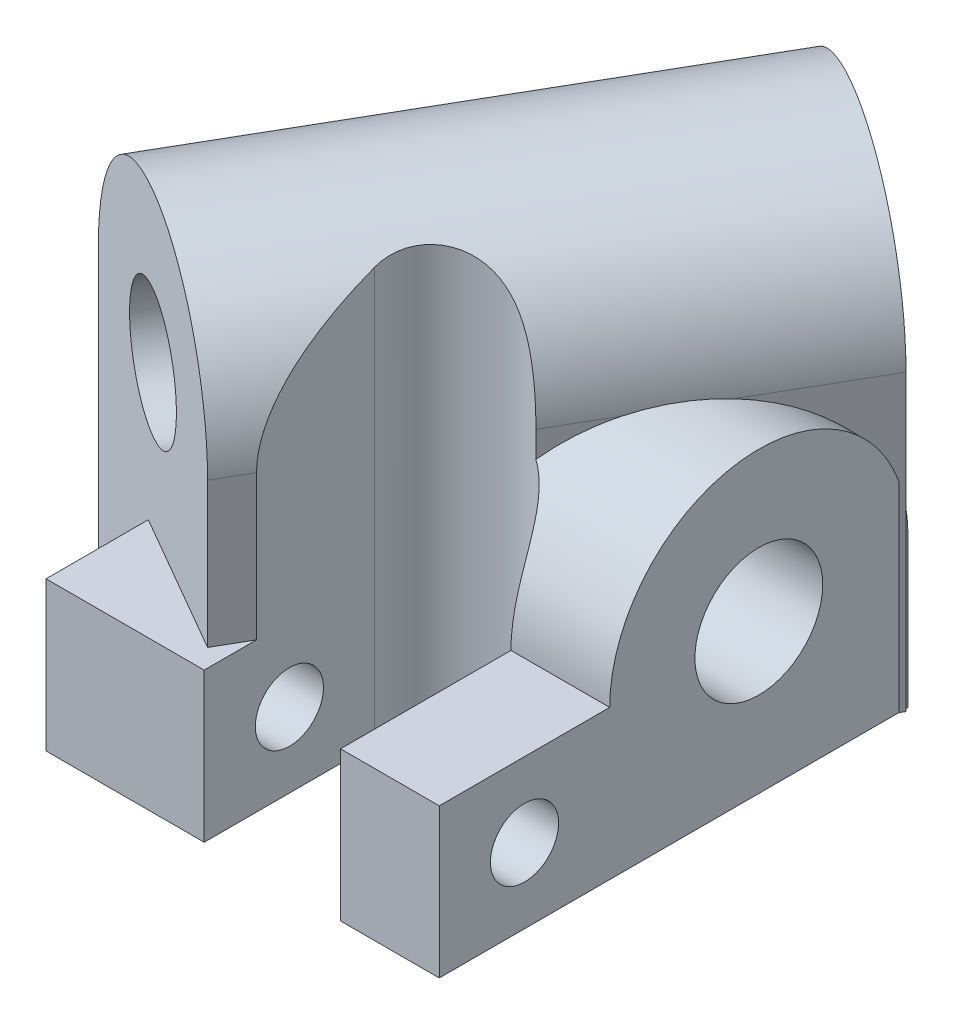
ISO-10303-21;
HEADER;
FILE_DESCRIPTION(('STEP AP214'),'2;1');
FILE_NAME('part.step','',(''),(''),'','','');
FILE_SCHEMA(('AUTOMOTIVE_DESIGN { 1 0 10303 214 1 1 1 1 }'));
ENDSEC;
DATA;
#1=APPLICATION_CONTEXT('core data for automotive mechanical design processes');
#2=APPLICATION_PROTOCOL_DEFINITION('international standard','automotive_design',2000,#1);
#3=PRODUCT_CONTEXT('',#1,'mechanical');
#4=PRODUCT('Part','Part','',(#3));
#5=PRODUCT_RELATED_PRODUCT_CATEGORY('part','',(#4));
#6=PRODUCT_DEFINITION_FORMATION('','',#4);
#7=PRODUCT_DEFINITION_CONTEXT('part definition',#1,'design');
#8=PRODUCT_DEFINITION('design','',#6,#7);
#9=PRODUCT_DEFINITION_SHAPE('','',#8);
#10=(LENGTH_UNIT() NAMED_UNIT(*) SI_UNIT(.MILLI.,.METRE.));
#11=(NAMED_UNIT(*) PLANE_ANGLE_UNIT() SI_UNIT($,.RADIAN.));
#12=(NAMED_UNIT(*) SI_UNIT($,.STERADIAN.) SOLID_ANGLE_UNIT());
#13=UNCERTAINTY_MEASURE_WITH_UNIT(LENGTH_MEASURE(1.E-05),#10,'distance_accuracy_value','');
#14=(GEOMETRIC_REPRESENTATION_CONTEXT(3) GLOBAL_UNCERTAINTY_ASSIGNED_CONTEXT((#13)) GLOBAL_UNIT_ASSIGNED_CONTEXT((#10,
#11,#12)) REPRESENTATION_CONTEXT('',''));
#15=CARTESIAN_POINT('',(0.,0.,0.));
#16=DIRECTION('',(0.,0.,1.));
#17=DIRECTION('',(1.,0.,0.));
#18=AXIS2_PLACEMENT_3D('',#15,#16,#17);
#19=CARTESIAN_POINT('',(30.1554445662278,17.25,-8.48076211353301));
#20=DIRECTION('',(-0.866025403784436,0.,-0.500000000000004));
#21=DIRECTION('',(-0.500000000000004,0.,0.866025403784436));
#22=AXIS2_PLACEMENT_3D('',#19,#20,#21);
#23=PLANE('',#22);
#24=DIRECTION('',(-0.500000000000004,0.,0.866025403784436));
#25=VECTOR('',#24,1.);
#26=CARTESIAN_POINT('',(30.1554445662278,17.25,-8.48076211353301));
#27=LINE('',#26,#25);
#28=CARTESIAN_POINT('',(24.0601163962181,17.25,2.07665596572951));
#29=VERTEX_POINT('',#28);
#30=CARTESIAN_POINT('',(22.207259421637,17.25,5.28589838486226));
#31=VERTEX_POINT('',#30);
#32=EDGE_CURVE('E326',#29,#31,#27,.T.);
#33=ORIENTED_EDGE('',*,*,#32,.T.);
#34=DIRECTION('',(0.,-1.,0.));
#35=VECTOR('',#34,1.);
#36=CARTESIAN_POINT('',(22.207259421637,26.,5.28589838486226));
#37=LINE('',#36,#35);
#38=CARTESIAN_POINT('',(22.207259421637,15.7229318270661,5.28589838486226));
#39=VERTEX_POINT('',#38);
#40=EDGE_CURVE('E40',#31,#39,#37,.T.);
#41=ORIENTED_EDGE('',*,*,#40,.T.);
#42=CARTESIAN_POINT('',(25.2590742770462,8.75,0.));
#43=DIRECTION('',(-0.866025403784436,0.,-0.500000000000004));
#44=DIRECTION('',(-0.500000000000004,0.,0.866025403784436));
#45=AXIS2_PLACEMENT_3D('',#42,#43,#44);
#46=ELLIPSE('',#45,10.1036297108185,8.75);
#47=EDGE_CURVE('E342',#39,#29,#46,.T.);
#48=ORIENTED_EDGE('',*,*,#47,.T.);
#49=EDGE_LOOP('',(#33,#41,#48));
#50=FACE_BOUND('',#49,.T.);
#51=ADVANCED_FACE('F32',(#50),#23,.F.);
#52=CARTESIAN_POINT('',(30.,8.75,0.));
#53=DIRECTION('',(1.,0.,0.));
#54=DIRECTION('',(0.,0.,-1.));
#55=AXIS2_PLACEMENT_3D('',#52,#53,#54);
#56=PLANE('',#55);
#57=CARTESIAN_POINT('',(30.,4.375,13.75));
#58=DIRECTION('',(1.,0.,0.));
#59=DIRECTION('',(0.,0.,-1.));
#60=AXIS2_PLACEMENT_3D('',#57,#58,#59);
#61=CIRCLE('',#60,2.);
#62=CARTESIAN_POINT('',(30.,4.375,11.75));
#63=VERTEX_POINT('',#62);
#64=EDGE_CURVE('E192',#63,#63,#61,.T.);
#65=ORIENTED_EDGE('',*,*,#64,.F.);
#66=EDGE_LOOP('',(#65));
#67=FACE_BOUND('',#66,.T.);
#68=CARTESIAN_POINT('',(30.,8.75,0.));
#69=DIRECTION('',(1.,0.,0.));
#70=DIRECTION('',(0.,0.,-1.));
#71=AXIS2_PLACEMENT_3D('',#68,#69,#70);
#72=CIRCLE('',#71,3.75);
#73=CARTESIAN_POINT('',(30.,8.75,-3.75));
#74=VERTEX_POINT('',#73);
#75=EDGE_CURVE('E356',#74,#74,#72,.T.);
#76=ORIENTED_EDGE('',*,*,#75,.F.);
#77=EDGE_LOOP('',(#76));
#78=FACE_BOUND('',#77,.T.);
#79=DIRECTION('',(0.,0.,-1.));
#80=VECTOR('',#79,1.);
#81=CARTESIAN_POINT('',(30.,0.,8.75));
#82=LINE('',#81,#80);
#83=CARTESIAN_POINT('',(30.,0.,18.75));
#84=VERTEX_POINT('',#83);
#85=CARTESIAN_POINT('',(30.,0.,-8.21152422706606));
#86=VERTEX_POINT('',#85);
#87=EDGE_CURVE('E319',#84,#86,#82,.T.);
#88=ORIENTED_EDGE('',*,*,#87,.T.);
#89=DIRECTION('',(0.,1.,0.));
#90=VECTOR('',#89,1.);
#91=CARTESIAN_POINT('',(30.,8.75000000000001,-8.21152422706605));
#92=LINE('',#91,#90);
#93=CARTESIAN_POINT('',(30.,11.772146566318,-8.21152422706604));
#94=VERTEX_POINT('',#93);
#95=EDGE_CURVE('E307',#86,#94,#92,.T.);
#96=ORIENTED_EDGE('',*,*,#95,.T.);
#97=CARTESIAN_POINT('',(30.,8.75,0.));
#98=DIRECTION('',(1.,0.,0.));
#99=DIRECTION('',(0.,0.,-1.));
#100=AXIS2_PLACEMENT_3D('',#97,#98,#99);
#101=CIRCLE('',#100,8.75);
#102=CARTESIAN_POINT('',(30.,8.75,8.75));
#103=VERTEX_POINT('',#102);
#104=EDGE_CURVE('E366',#94,#103,#101,.T.);
#105=ORIENTED_EDGE('',*,*,#104,.T.);
#106=DIRECTION('',(0.,0.,1.));
#107=VECTOR('',#106,1.);
#108=CARTESIAN_POINT('',(30.,8.75,18.75));
#109=LINE('',#108,#107);
#110=CARTESIAN_POINT('',(30.,8.75,18.75));
#111=VERTEX_POINT('',#110);
#112=EDGE_CURVE('E215',#103,#111,#109,.T.);
#113=ORIENTED_EDGE('',*,*,#112,.T.);
#114=DIRECTION('',(0.,-1.,0.));
#115=VECTOR('',#114,1.);
#116=CARTESIAN_POINT('',(30.,8.75,18.75));
#117=LINE('',#116,#115);
#118=EDGE_CURVE('E225',#111,#84,#117,.T.);
#119=ORIENTED_EDGE('',*,*,#118,.T.);
#120=EDGE_LOOP('',(#88,#96,#105,#113,#119));
#121=FACE_BOUND('',#120,.T.);
#122=ADVANCED_FACE('F286',(#67,#78,#121),#56,.T.);
#123=CARTESIAN_POINT('',(30.,0.,-8.75));
#124=DIRECTION('',(0.,0.,1.));
#125=DIRECTION('',(1.,0.,0.));
#126=AXIS2_PLACEMENT_3D('',#123,#124,#125);
#127=PLANE('',#126);
#128=DIRECTION('',(0.,1.,0.));
#129=VECTOR('',#128,1.);
#130=CARTESIAN_POINT('',(10.1036297108186,0.,-8.75));
#131=LINE('',#130,#129);
#132=CARTESIAN_POINT('',(10.1036297108186,0.,-8.75));
#133=VERTEX_POINT('',#132);
#134=CARTESIAN_POINT('',(10.1036297108186,8.75,-8.75));
#135=VERTEX_POINT('',#134);
#136=EDGE_CURVE('E347',#133,#135,#131,.T.);
#137=ORIENTED_EDGE('',*,*,#136,.F.);
#138=DIRECTION('',(-1.,0.,0.));
#139=VECTOR('',#138,1.);
#140=CARTESIAN_POINT('',(30.,0.,-8.75));
#141=LINE('',#140,#139);
#142=CARTESIAN_POINT('',(0.,0.,-8.75));
#143=VERTEX_POINT('',#142);
#144=EDGE_CURVE('E387',#133,#143,#141,.T.);
#145=ORIENTED_EDGE('',*,*,#144,.T.);
#146=DIRECTION('',(0.,1.,0.));
#147=VECTOR('',#146,1.);
#148=CARTESIAN_POINT('',(0.,0.,-8.75));
#149=LINE('',#148,#147);
#150=CARTESIAN_POINT('',(0.,8.75,-8.75));
#151=VERTEX_POINT('',#150);
#152=EDGE_CURVE('E376',#143,#151,#149,.T.);
#153=ORIENTED_EDGE('',*,*,#152,.T.);
#154=DIRECTION('',(-1.,0.,0.));
#155=VECTOR('',#154,1.);
#156=CARTESIAN_POINT('',(30.,8.75,-8.75));
#157=LINE('',#156,#155);
#158=EDGE_CURVE('E383',#135,#151,#157,.T.);
#159=ORIENTED_EDGE('',*,*,#158,.F.);
#160=EDGE_LOOP('',(#137,#145,#153,#159));
#161=FACE_BOUND('',#160,.T.);
#162=ADVANCED_FACE('F292',(#161),#127,.F.);
#163=CARTESIAN_POINT('',(30.,8.75,0.));
#164=DIRECTION('',(-1.,0.,0.));
#165=DIRECTION('',(0.,0.,1.));
#166=AXIS2_PLACEMENT_3D('',#163,#164,#165);
#167=CYLINDRICAL_SURFACE('',#166,8.75);
#168=CARTESIAN_POINT('',(5.05181485540928,8.75,0.));
#169=DIRECTION('',(0.866025403784436,0.,0.500000000000004));
#170=DIRECTION('',(-0.500000000000004,0.,0.866025403784436));
#171=AXIS2_PLACEMENT_3D('',#168,#169,#170);
#172=ELLIPSE('',#171,10.1036297108185,8.75);
#173=CARTESIAN_POINT('',(6.25077273623748,17.25,-2.07665596572953));
#174=VERTEX_POINT('',#173);
#175=EDGE_CURVE('E346',#135,#174,#172,.T.);
#176=ORIENTED_EDGE('',*,*,#175,.F.);
#177=ORIENTED_EDGE('',*,*,#158,.T.);
#178=CARTESIAN_POINT('',(0.,8.75,0.));
#179=DIRECTION('',(1.,0.,0.));
#180=DIRECTION('',(0.,0.,-1.));
#181=AXIS2_PLACEMENT_3D('',#178,#179,#180);
#182=CIRCLE('',#181,8.75);
#183=CARTESIAN_POINT('',(0.,8.75,8.75));
#184=VERTEX_POINT('',#183);
#185=EDGE_CURVE('E379',#151,#184,#182,.T.);
#186=ORIENTED_EDGE('',*,*,#185,.T.);
#187=CARTESIAN_POINT('',(3.85285697458108,17.25,2.07665596572953));
#188=VERTEX_POINT('',#187);
#189=EDGE_CURVE('E316',#188,#184,#172,.T.);
#190=ORIENTED_EDGE('',*,*,#189,.F.);
#191=CARTESIAN_POINT('',(6.25077273623748,17.25,-2.07665596572953));
#192=CARTESIAN_POINT('',(6.17045305423663,17.2839955158162,-1.93752118965594));
#193=CARTESIAN_POINT('',(6.08992669708827,17.3145407726905,-1.79766573743263));
#194=CARTESIAN_POINT('',(5.92845414899194,17.3687042069313,-1.51686167601603));
#195=CARTESIAN_POINT('',(5.84750796197914,17.3923224491074,-1.37591307706296));
#196=CARTESIAN_POINT('',(5.68514484693701,17.4326165812872,-1.09319356352859));
#197=CARTESIAN_POINT('',(5.60372769259806,17.4492887932685,-0.95142225349095));
#198=CARTESIAN_POINT('',(5.44052248566032,17.4756709734203,-0.667459190548528));
#199=CARTESIAN_POINT('',(5.35873443607839,17.4853809981191,-0.525267441066848));
#200=CARTESIAN_POINT('',(5.11573925489823,17.5038639870459,-0.10337892787786));
#201=CARTESIAN_POINT('',(4.95408084797536,17.5026841834947,0.176553909262585));
#202=CARTESIAN_POINT('',(4.63084663215437,17.4735677881277,0.734828019402746));
#203=CARTESIAN_POINT('',(4.46927083873285,17.4456487685698,1.01317021688613));
#204=CARTESIAN_POINT('',(4.23223408822682,17.3847720872609,1.42159042234583));
#205=CARTESIAN_POINT('',(4.15605832048719,17.3621389081463,1.55285602570154));
#206=CARTESIAN_POINT('',(4.00405358423578,17.3107093865198,1.8151228385504));
#207=CARTESIAN_POINT('',(3.92822735199661,17.2818879476154,1.94612071065994));
#208=CARTESIAN_POINT('',(3.85285697458108,17.25,2.07665596572953));
#209=B_SPLINE_CURVE_WITH_KNOTS('',3,(#191,#192,#193,#194,#195,#196,#197,#198,#199,#200,#201,
#202,#203,#204,#205,#206,#207,#208),.UNSPECIFIED.,.F.,.F.,(4,2,2,2,2,2,2,2,4),(0.,
0.492592446399339,0.985180283919886,1.47802862326541,1.97087296096945,2.93946951707011,
3.90742997531448,4.36766174258732,4.8297964680422),.UNSPECIFIED.);
#210=EDGE_CURVE('E396',#174,#188,#209,.T.);
#211=ORIENTED_EDGE('',*,*,#210,.F.);
#212=EDGE_LOOP('',(#176,#177,#186,#190,#211));
#213=FACE_BOUND('',#212,.T.);
#214=ADVANCED_FACE('F401',(#213),#167,.T.);
#215=ORIENTED_EDGE('',*,*,#47,.F.);
#216=CARTESIAN_POINT('',(20.1485029781668,16.0981902508714,4.75043156323701));
#217=CARTESIAN_POINT('',(20.2442905484469,16.0990964128763,4.74900732212532));
#218=CARTESIAN_POINT('',(20.340147948157,16.0977846801699,4.7510573078996));
#219=CARTESIAN_POINT('',(20.5312961580327,16.0907040057593,4.76200214444356));
#220=CARTESIAN_POINT('',(20.62658702579,16.0849355251989,4.77089628704157));
#221=CARTESIAN_POINT('',(20.8157295258631,16.0689359085176,4.79540143297364));
#222=CARTESIAN_POINT('',(20.9095836238424,16.0587135869906,4.81099916840711));
#223=CARTESIAN_POINT('',(21.0953686233684,16.033766116063,4.84868696111031));
#224=CARTESIAN_POINT('',(21.1872995379011,16.0190409970775,4.87077697452626));
#225=CARTESIAN_POINT('',(21.3685994212124,15.9850375665874,4.92114342029558));
#226=CARTESIAN_POINT('',(21.4579680864919,15.9657587181704,4.94942058212212));
#227=CARTESIAN_POINT('',(21.6335520283011,15.922594360825,5.01176888879183));
#228=CARTESIAN_POINT('',(21.7197661273677,15.898707152247,5.04584217080266));
#229=CARTESIAN_POINT('',(21.8883988079629,15.8463115266805,5.11926692057997));
#230=CARTESIAN_POINT('',(21.9708194290293,15.8178056310626,5.15861550651331));
#231=CARTESIAN_POINT('',(22.1314500792258,15.7561446364365,5.24205388875792));
#232=CARTESIAN_POINT('',(22.2096585272862,15.7229878082684,5.28614544702039));
#233=CARTESIAN_POINT('',(22.3623878181195,15.6516023087653,5.37901978809682));
#234=CARTESIAN_POINT('',(22.4368490599915,15.6133144581029,5.42785513484066));
#235=CARTESIAN_POINT('',(22.5806815743442,15.532071262806,5.52903532449174));
#236=CARTESIAN_POINT('',(22.6500510161901,15.4891142531241,5.58138141678472));
#237=CARTESIAN_POINT('',(22.8501243072632,15.3533953417673,5.74258791053661));
#238=CARTESIAN_POINT('',(22.9728849313336,15.2537427437506,5.85567365963137));
#239=CARTESIAN_POINT('',(23.2057052238415,15.0286627266507,6.09674370316369));
#240=CARTESIAN_POINT('',(23.3138600417606,14.9017811191412,6.22518494452467));
#241=CARTESIAN_POINT('',(23.5059358019272,14.6307178384615,6.48185911955175));
#242=CARTESIAN_POINT('',(23.5898470933866,14.4865293080448,6.61009195011167));
#243=CARTESIAN_POINT('',(23.7198716432647,14.2175353124912,6.8331524507467));
#244=CARTESIAN_POINT('',(23.7702412238995,14.0956033926039,6.92903900060324));
#245=CARTESIAN_POINT('',(23.8597585451508,13.8440902187252,7.11598849286189));
#246=CARTESIAN_POINT('',(23.8989012030552,13.7145055320458,7.20704923533813));
#247=CARTESIAN_POINT('',(23.9676996621239,13.4485035997608,7.38323022514537));
#248=CARTESIAN_POINT('',(23.9973320520409,13.3120704348112,7.46833541555332));
#249=CARTESIAN_POINT('',(24.0486423087337,13.0335826501128,7.63147986516758));
#250=CARTESIAN_POINT('',(24.0703178953492,12.8915264318802,7.70951709410827));
#251=CARTESIAN_POINT('',(24.1144027988967,12.5467185308072,7.88657843770023));
#252=CARTESIAN_POINT('',(24.1338506380246,12.3417505595027,7.98203912912937));
#253=CARTESIAN_POINT('',(24.1640542283199,11.9244550570637,8.15699620768429));
#254=CARTESIAN_POINT('',(24.174806091652,11.7121242783255,8.23648544229791));
#255=CARTESIAN_POINT('',(24.1906393837072,11.2817951419793,8.37877409245609));
#256=CARTESIAN_POINT('',(24.195721913766,11.0637978935737,8.44157674776165));
#257=CARTESIAN_POINT('',(24.2026277636208,10.6236455217183,8.55004817860867));
#258=CARTESIAN_POINT('',(24.2044523841605,10.4014920934668,8.59572378648859));
#259=CARTESIAN_POINT('',(24.2066875232759,9.94169498564568,8.67177305051995));
#260=CARTESIAN_POINT('',(24.2070127726699,9.70388260960126,8.70114204801667));
#261=CARTESIAN_POINT('',(24.2072217138656,9.34637171643065,8.73046961533928));
#262=CARTESIAN_POINT('',(24.2072450305433,9.22723348079246,8.7377911513655));
#263=CARTESIAN_POINT('',(24.2072603946276,8.98873497340255,8.74755669108357));
#264=CARTESIAN_POINT('',(24.2072524361939,8.86937466434113,8.74999978365514));
#265=CARTESIAN_POINT('',(24.2072594216369,8.75,8.75));
#266=B_SPLINE_CURVE_WITH_KNOTS('',3,(#216,#217,#218,#219,#220,#221,#222,#223,#224,#225,#226,
#227,#228,#229,#230,#231,#232,#233,#234,#235,#236,#237,#238,#239,#240,#241,#242,#243,#244,#245,
#246,#247,#248,#249,#250,#251,#252,#253,#254,#255,#256,#257,#258,#259,#260,#261,#262,#263,#264,
#265),.UNSPECIFIED.,.F.,.F.,(4,2,2,2,2,2,2,2,2,2,2,2,2,2,2,2,2,2,2,2,2,2,2,2,4),(0.,
0.287315853760752,0.574601982663118,0.861322108208879,1.14804029707345,1.4347923086337,
1.72165028259402,2.00835218333389,2.29516096025176,2.58561999366466,2.87618294829894,
3.45696385425701,4.08603684366191,4.71535990855098,5.20398572847379,5.69283241376325,
6.18287341429806,6.67305473517355,7.35290874207197,8.03306653333264,8.71309217278946,
9.39284624641988,10.1108166450022,10.4688201122941,10.8268904356908),.UNSPECIFIED.);
#267=CARTESIAN_POINT('',(24.2072594216369,8.75,8.75));
#268=VERTEX_POINT('',#267);
#269=EDGE_CURVE('E255',#39,#268,#266,.T.);
#270=ORIENTED_EDGE('',*,*,#269,.T.);
#271=DIRECTION('',(-1.,0.,0.));
#272=VECTOR('',#271,1.);
#273=CARTESIAN_POINT('',(30.,8.75,8.75));
#274=LINE('',#273,#272);
#275=EDGE_CURVE('E370',#103,#268,#274,.T.);
#276=ORIENTED_EDGE('',*,*,#275,.F.);
#277=ORIENTED_EDGE('',*,*,#104,.F.);
#278=CARTESIAN_POINT('',(26.4580321578744,17.25,-2.07665596572952));
#279=VERTEX_POINT('',#278);
#280=EDGE_CURVE('E313',#279,#94,#46,.T.);
#281=ORIENTED_EDGE('',*,*,#280,.F.);
#282=CARTESIAN_POINT('',(24.060116396218,17.25,2.07665596572952));
#283=CARTESIAN_POINT('',(24.1404360782189,17.2839955158162,1.93752118965593));
#284=CARTESIAN_POINT('',(24.2209624353673,17.3145407726905,1.79766573743262));
#285=CARTESIAN_POINT('',(24.3824349834636,17.3687042069313,1.51686167601602));
#286=CARTESIAN_POINT('',(24.4633811704764,17.3923224491074,1.37591307706295));
#287=CARTESIAN_POINT('',(24.6257442855185,17.4326165812872,1.09319356352858));
#288=CARTESIAN_POINT('',(24.7071614398575,17.4492887932685,0.951422253490937));
#289=CARTESIAN_POINT('',(24.8703666467952,17.4756709734203,0.667459190548515));
#290=CARTESIAN_POINT('',(24.9521546963771,17.4853809981191,0.525267441066837));
#291=CARTESIAN_POINT('',(25.1951498775573,17.5038639870459,0.103378927877851));
#292=CARTESIAN_POINT('',(25.3568082844802,17.5026841834947,-0.176553909262594));
#293=CARTESIAN_POINT('',(25.6800425003012,17.4735677881277,-0.734828019402755));
#294=CARTESIAN_POINT('',(25.8416182937227,17.4456487685698,-1.01317021688614));
#295=CARTESIAN_POINT('',(26.0786550442287,17.3847720872609,-1.42159042234583));
#296=CARTESIAN_POINT('',(26.1548308119683,17.3621389081463,-1.55285602570154));
#297=CARTESIAN_POINT('',(26.3068355482197,17.3107093865198,-1.8151228385504));
#298=CARTESIAN_POINT('',(26.3826617804589,17.2818879476154,-1.94612071065993));
#299=CARTESIAN_POINT('',(26.4580321578744,17.25,-2.07665596572952));
#300=B_SPLINE_CURVE_WITH_KNOTS('',3,(#282,#283,#284,#285,#286,#287,#288,#289,#290,#291,#292,
#293,#294,#295,#296,#297,#298,#299),.UNSPECIFIED.,.F.,.F.,(4,2,2,2,2,2,2,2,4),(0.,
0.49259244639934,0.985180283919886,1.47802862326541,1.97087296096945,2.9394695170701,
3.90742997531448,4.36766174258731,4.82979646804217),.UNSPECIFIED.);
#301=EDGE_CURVE('E390',#29,#279,#300,.T.);
#302=ORIENTED_EDGE('',*,*,#301,.F.);
#303=EDGE_LOOP('',(#215,#270,#276,#277,#281,#302));
#304=FACE_BOUND('',#303,.T.);
#305=ADVANCED_FACE('F405',(#304),#167,.T.);
#306=CARTESIAN_POINT('',(30.,8.75,-8.75));
#307=VERTEX_POINT('',#306);
#308=CARTESIAN_POINT('',(29.6891108675445,8.75,-8.75));
#309=VERTEX_POINT('',#308);
#310=EDGE_CURVE('E384',#307,#309,#157,.T.);
#311=ORIENTED_EDGE('',*,*,#310,.T.);
#312=CARTESIAN_POINT('',(44.844555433772,8.75,0.));
#313=DIRECTION('',(0.500000000000004,0.,-0.866025403784436));
#314=DIRECTION('',(-0.866025403784436,0.,-0.500000000000004));
#315=AXIS2_PLACEMENT_3D('',#312,#313,#314);
#316=ELLIPSE('',#315,17.4999999999999,8.75);
#317=CARTESIAN_POINT('',(30.,10.5132048447515,-8.57050807568867));
#318=VERTEX_POINT('',#317);
#319=EDGE_CURVE('E461',#309,#318,#316,.T.);
#320=ORIENTED_EDGE('',*,*,#319,.T.);
#321=EDGE_CURVE('E367',#307,#318,#101,.T.);
#322=ORIENTED_EDGE('',*,*,#321,.F.);
#323=EDGE_LOOP('',(#311,#320,#322));
#324=FACE_BOUND('',#323,.T.);
#325=ADVANCED_FACE('F407',(#324),#167,.T.);
#326=CARTESIAN_POINT('',(30.,8.75,0.));
#327=DIRECTION('',(-1.,0.,0.));
#328=DIRECTION('',(0.,0.,1.));
#329=AXIS2_PLACEMENT_3D('',#326,#327,#328);
#330=CYLINDRICAL_SURFACE('',#329,3.75);
#331=ORIENTED_EDGE('',*,*,#75,.T.);
#332=EDGE_LOOP('',(#331));
#333=FACE_BOUND('',#332,.T.);
#334=CARTESIAN_POINT('',(0.,8.75,0.));
#335=DIRECTION('',(1.,0.,0.));
#336=DIRECTION('',(0.,0.,-1.));
#337=AXIS2_PLACEMENT_3D('',#334,#335,#336);
#338=CIRCLE('',#337,3.75);
#339=CARTESIAN_POINT('',(0.,8.75,-3.75));
#340=VERTEX_POINT('',#339);
#341=EDGE_CURVE('E355',#340,#340,#338,.T.);
#342=ORIENTED_EDGE('',*,*,#341,.F.);
#343=EDGE_LOOP('',(#342));
#344=FACE_BOUND('',#343,.T.);
#345=ADVANCED_FACE('F518',(#333,#344),#330,.F.);
#346=DIRECTION('',(0.,1.,0.));
#347=VECTOR('',#346,1.);
#348=CARTESIAN_POINT('',(30.,8.75,-8.57050807568867));
#349=LINE('',#348,#347);
#350=CARTESIAN_POINT('',(30.,0.,-8.57050807568867));
#351=VERTEX_POINT('',#350);
#352=EDGE_CURVE('E352',#351,#318,#349,.T.);
#353=ORIENTED_EDGE('',*,*,#352,.F.);
#354=CARTESIAN_POINT('',(30.,0.,-8.75));
#355=VERTEX_POINT('',#354);
#356=EDGE_CURVE('E364',#351,#355,#82,.T.);
#357=ORIENTED_EDGE('',*,*,#356,.T.);
#358=DIRECTION('',(0.,1.,0.));
#359=VECTOR('',#358,1.);
#360=CARTESIAN_POINT('',(30.,0.,-8.75));
#361=LINE('',#360,#359);
#362=EDGE_CURVE('E363',#355,#307,#361,.T.);
#363=ORIENTED_EDGE('',*,*,#362,.T.);
#364=ORIENTED_EDGE('',*,*,#321,.T.);
#365=EDGE_LOOP('',(#353,#357,#363,#364));
#366=FACE_BOUND('',#365,.T.);
#367=ADVANCED_FACE('F295',(#366),#56,.T.);
#368=CARTESIAN_POINT('',(0.,8.75,0.));
#369=DIRECTION('',(1.,0.,0.));
#370=DIRECTION('',(0.,0.,-1.));
#371=AXIS2_PLACEMENT_3D('',#368,#369,#370);
#372=PLANE('',#371);
#373=DIRECTION('',(0.,-1.,0.));
#374=VECTOR('',#373,1.);
#375=CARTESIAN_POINT('',(0.,8.75,8.75));
#376=LINE('',#375,#374);
#377=CARTESIAN_POINT('',(0.,0.,8.75));
#378=VERTEX_POINT('',#377);
#379=EDGE_CURVE('E359',#184,#378,#376,.T.);
#380=ORIENTED_EDGE('',*,*,#379,.F.);
#381=ORIENTED_EDGE('',*,*,#185,.F.);
#382=ORIENTED_EDGE('',*,*,#152,.F.);
#383=DIRECTION('',(0.,0.,-1.));
#384=VECTOR('',#383,1.);
#385=CARTESIAN_POINT('',(0.,0.,8.75));
#386=LINE('',#385,#384);
#387=EDGE_CURVE('E373',#378,#143,#386,.T.);
#388=ORIENTED_EDGE('',*,*,#387,.F.);
#389=EDGE_LOOP('',(#380,#381,#382,#388));
#390=FACE_BOUND('',#389,.T.);
#391=ORIENTED_EDGE('',*,*,#341,.T.);
#392=EDGE_LOOP('',(#391));
#393=FACE_BOUND('',#392,.T.);
#394=ADVANCED_FACE('F408',(#390,#393),#372,.F.);
#395=CARTESIAN_POINT('',(30.,0.,8.75));
#396=DIRECTION('',(0.,1.,0.));
#397=DIRECTION('',(0.,0.,1.));
#398=AXIS2_PLACEMENT_3D('',#395,#396,#397);
#399=PLANE('',#398);
#400=DIRECTION('',(0.,0.,-1.));
#401=VECTOR('',#400,1.);
#402=CARTESIAN_POINT('',(16.2072594216369,0.,15.6782032302754));
#403=LINE('',#402,#401);
#404=CARTESIAN_POINT('',(16.2072594216369,0.,18.75));
#405=VERTEX_POINT('',#404);
#406=CARTESIAN_POINT('',(16.2072594216369,0.,8.75));
#407=VERTEX_POINT('',#406);
#408=EDGE_CURVE('E236',#405,#407,#403,.T.);
#409=ORIENTED_EDGE('',*,*,#408,.F.);
#410=DIRECTION('',(-1.,0.,0.));
#411=VECTOR('',#410,1.);
#412=CARTESIAN_POINT('',(16.2072594216369,0.,18.75));
#413=LINE('',#412,#411);
#414=CARTESIAN_POINT('',(6.92820323027535,0.,18.75));
#415=VERTEX_POINT('',#414);
#416=EDGE_CURVE('E492',#405,#415,#413,.T.);
#417=ORIENTED_EDGE('',*,*,#416,.T.);
#418=DIRECTION('',(0.,0.,-1.));
#419=VECTOR('',#418,1.);
#420=CARTESIAN_POINT('',(6.92820323027535,0.,18.75));
#421=LINE('',#420,#419);
#422=CARTESIAN_POINT('',(6.92820323027553,0.,12.7500000000001));
#423=VERTEX_POINT('',#422);
#424=EDGE_CURVE('E501',#415,#423,#421,.T.);
#425=ORIENTED_EDGE('',*,*,#424,.T.);
#426=DIRECTION('',(-0.866025403784436,0.,-0.500000000000004));
#427=VECTOR('',#426,1.);
#428=CARTESIAN_POINT('',(15.1554445662276,0.,17.5000000000001));
#429=LINE('',#428,#427);
#430=EDGE_CURVE('E441',#423,#378,#429,.T.);
#431=ORIENTED_EDGE('',*,*,#430,.T.);
#432=ORIENTED_EDGE('',*,*,#387,.T.);
#433=ORIENTED_EDGE('',*,*,#144,.F.);
#434=DIRECTION('',(-0.500000000000004,0.,0.866025403784436));
#435=VECTOR('',#434,1.);
#436=CARTESIAN_POINT('',(15.0000000000001,0.,-17.2307621135331));
#437=LINE('',#436,#435);
#438=CARTESIAN_POINT('',(15.0000000000001,0.,-17.2307621135331));
#439=VERTEX_POINT('',#438);
#440=EDGE_CURVE('E339',#439,#133,#437,.T.);
#441=ORIENTED_EDGE('',*,*,#440,.F.);
#442=DIRECTION('',(-0.866025403784436,0.,-0.500000000000004));
#443=VECTOR('',#442,1.);
#444=CARTESIAN_POINT('',(30.1554445662277,0.,-8.48076211353302));
#445=LINE('',#444,#443);
#446=CARTESIAN_POINT('',(29.6891108675445,0.,-8.75));
#447=VERTEX_POINT('',#446);
#448=EDGE_CURVE('E437',#447,#439,#445,.T.);
#449=ORIENTED_EDGE('',*,*,#448,.F.);
#450=EDGE_CURVE('E388',#355,#447,#141,.T.);
#451=ORIENTED_EDGE('',*,*,#450,.F.);
#452=ORIENTED_EDGE('',*,*,#356,.F.);
#453=CARTESIAN_POINT('',(30.1554445662277,0.,-8.48076211353302));
#454=VERTEX_POINT('',#453);
#455=EDGE_CURVE('E322',#454,#351,#445,.T.);
#456=ORIENTED_EDGE('',*,*,#455,.F.);
#457=DIRECTION('',(-0.500000000000004,0.,0.866025403784436));
#458=VECTOR('',#457,1.);
#459=CARTESIAN_POINT('',(30.1554445662277,0.,-8.48076211353302));
#460=LINE('',#459,#458);
#461=EDGE_CURVE('E310',#454,#86,#460,.T.);
#462=ORIENTED_EDGE('',*,*,#461,.T.);
#463=ORIENTED_EDGE('',*,*,#87,.F.);
#464=DIRECTION('',(-1.,0.,0.));
#465=VECTOR('',#464,1.);
#466=CARTESIAN_POINT('',(24.2072594216369,0.,18.75));
#467=LINE('',#466,#465);
#468=CARTESIAN_POINT('',(24.2072594216369,0.,18.75));
#469=VERTEX_POINT('',#468);
#470=EDGE_CURVE('E214',#84,#469,#467,.T.);
#471=ORIENTED_EDGE('',*,*,#470,.T.);
#472=DIRECTION('',(0.,0.,-1.));
#473=VECTOR('',#472,1.);
#474=CARTESIAN_POINT('',(24.2072594216369,0.,8.75));
#475=LINE('',#474,#473);
#476=CARTESIAN_POINT('',(24.2072594216369,0.,8.75));
#477=VERTEX_POINT('',#476);
#478=EDGE_CURVE('E219',#469,#477,#475,.T.);
#479=ORIENTED_EDGE('',*,*,#478,.T.);
#480=CARTESIAN_POINT('',(20.2072594216369,0.,8.75));
#481=DIRECTION('',(0.,-1.,0.));
#482=DIRECTION('',(0.,0.,-1.));
#483=AXIS2_PLACEMENT_3D('',#480,#481,#482);
#484=CIRCLE('',#483,4.);
#485=EDGE_CURVE('E232',#407,#477,#484,.T.);
#486=ORIENTED_EDGE('',*,*,#485,.F.);
#487=EDGE_LOOP('',(#409,#417,#425,#431,#432,#433,#441,#449,#451,#452,#456,#462,#463,#471,#479,#486));
#488=FACE_BOUND('',#487,.T.);
#489=ADVANCED_FACE('F34',(#488),#399,.F.);
#490=ORIENTED_EDGE('',*,*,#450,.T.);
#491=DIRECTION('',(0.,1.,0.));
#492=VECTOR('',#491,1.);
#493=CARTESIAN_POINT('',(29.6891108675445,0.,-8.75));
#494=LINE('',#493,#492);
#495=EDGE_CURVE('E350',#447,#309,#494,.T.);
#496=ORIENTED_EDGE('',*,*,#495,.T.);
#497=ORIENTED_EDGE('',*,*,#310,.F.);
#498=ORIENTED_EDGE('',*,*,#362,.F.);
#499=EDGE_LOOP('',(#490,#496,#497,#498));
#500=FACE_BOUND('',#499,.T.);
#501=ADVANCED_FACE('F409',(#500),#127,.F.);
#502=CARTESIAN_POINT('',(22.5777222831139,17.25,-12.855762113533));
#503=DIRECTION('',(-0.500000000000004,0.,0.866025403784436));
#504=DIRECTION('',(0.866025403784436,0.,0.500000000000004));
#505=AXIS2_PLACEMENT_3D('',#502,#503,#504);
#506=CYLINDRICAL_SURFACE('',#505,8.75);
#507=CARTESIAN_POINT('',(16.2072594216369,17.25,-1.8217967697244));
#508=DIRECTION('',(-1.,0.,0.));
#509=DIRECTION('',(0.,0.,1.));
#510=AXIS2_PLACEMENT_3D('',#507,#508,#509);
#511=ELLIPSE('',#510,17.4999999999999,8.75);
#512=CARTESIAN_POINT('',(16.207259421637,17.25,15.6782032302754));
#513=VERTEX_POINT('',#512);
#514=CARTESIAN_POINT('',(16.2072594216369,24.2229318270661,8.75));
#515=VERTEX_POINT('',#514);
#516=EDGE_CURVE('E242',#513,#515,#511,.T.);
#517=ORIENTED_EDGE('',*,*,#516,.T.);
#518=CARTESIAN_POINT('',(16.2072594216369,24.2229318270661,8.75));
#519=CARTESIAN_POINT('',(16.2072416900731,24.2569234332014,8.66034030331076));
#520=CARTESIAN_POINT('',(16.2102735481982,24.2885777785958,8.56978636666348));
#521=CARTESIAN_POINT('',(16.2226684522539,24.3472271086901,8.38759858216394));
#522=CARTESIAN_POINT('',(16.2320322434017,24.3742215444869,8.29596460844751));
#523=CARTESIAN_POINT('',(16.2573212758354,24.4235545921625,8.11236026402275));
#524=CARTESIAN_POINT('',(16.2732455521865,24.4458938880052,8.02038994475594));
#525=CARTESIAN_POINT('',(16.311756837031,24.485961376223,7.83684650071917));
#526=CARTESIAN_POINT('',(16.334343384323,24.5036898876237,7.74527334890008));
#527=CARTESIAN_POINT('',(16.3862191245825,24.5346045742314,7.56314367547686));
#528=CARTESIAN_POINT('',(16.4155162516385,24.5477853258999,7.47258849146888));
#529=CARTESIAN_POINT('',(16.4807189953254,24.5696269989561,7.2932915831025));
#530=CARTESIAN_POINT('',(16.5166270786038,24.5782862286541,7.20455054940754));
#531=CARTESIAN_POINT('',(16.5948261284263,24.5911086682576,7.02968272299817));
#532=CARTESIAN_POINT('',(16.637111635493,24.5952756991446,6.94355376920454));
#533=CARTESIAN_POINT('',(16.7278314827624,24.5991468429706,6.77445177041683));
#534=CARTESIAN_POINT('',(16.7762680770941,24.5988493151196,6.69147989692709));
#535=CARTESIAN_POINT('',(16.8781805111592,24.5938223936971,6.53050046325465));
#536=CARTESIAN_POINT('',(16.9315738955166,24.5891567746854,6.45243868351909));
#537=CARTESIAN_POINT('',(17.0435742677627,24.5754614702348,6.3005090472685));
#538=CARTESIAN_POINT('',(17.1021831419838,24.566430200555,6.22664272411549));
#539=CARTESIAN_POINT('',(17.2240920742273,24.5439686437521,6.08362804036619));
#540=CARTESIAN_POINT('',(17.2873911132268,24.5305393100319,6.01447866116297));
#541=CARTESIAN_POINT('',(17.4181564195855,24.4992292623076,5.88126879478766));
#542=CARTESIAN_POINT('',(17.4856242155284,24.4813469081167,5.81721019420273));
#543=CARTESIAN_POINT('',(17.6241892437764,24.4410565497144,5.69445942009521));
#544=CARTESIAN_POINT('',(17.6952917476368,24.4186418243987,5.63577540661964));
#545=CARTESIAN_POINT('',(17.8403854327411,24.3692576971032,5.5241217527577));
#546=CARTESIAN_POINT('',(17.9143776432015,24.3422866607321,5.47115417412333));
#547=CARTESIAN_POINT('',(18.0644757206264,24.2837944790146,5.37115315072109));
#548=CARTESIAN_POINT('',(18.1405804458933,24.2522757542125,5.32411657393031));
#549=CARTESIAN_POINT('',(18.2942377208551,24.1846807881664,5.23599995964049));
#550=CARTESIAN_POINT('',(18.3717907989317,24.1486028548364,5.19492214587271));
#551=CARTESIAN_POINT('',(18.5299746594293,24.0707736835929,5.11754903707357));
#552=CARTESIAN_POINT('',(18.610627057986,24.0288827409844,5.08143830558921));
#553=CARTESIAN_POINT('',(18.7719065972825,23.9404248751761,5.01538225385892));
#554=CARTESIAN_POINT('',(18.8525337182879,23.8938562635429,4.98543917184739));
#555=CARTESIAN_POINT('',(19.0932382548884,23.7473508926881,4.90454220916992));
#556=CARTESIAN_POINT('',(19.2522394416163,23.6405657030815,4.86247279259423));
#557=CARTESIAN_POINT('',(19.5773058886729,23.3992843243075,4.79609148185935));
#558=CARTESIAN_POINT('',(19.7425321754097,23.2630968434647,4.77392839311018));
#559=CARTESIAN_POINT('',(20.0588108469365,22.9736132342283,4.74960525613952));
#560=CARTESIAN_POINT('',(20.2098563199326,22.8203088418498,4.74745491263084));
#561=CARTESIAN_POINT('',(20.4664979757411,22.531864973938,4.75677972155505));
#562=CARTESIAN_POINT('',(20.5751221629107,22.3992819606825,4.76559893152575));
#563=CARTESIAN_POINT('',(20.7813230419677,22.1263072146341,4.79004617059351));
#564=CARTESIAN_POINT('',(20.878894349599,21.9859117253379,4.80567750030168));
#565=CARTESIAN_POINT('',(21.063086292812,21.6981517797951,4.84149749557106));
#566=CARTESIAN_POINT('',(21.1496756212133,21.550768975512,4.86169875259596));
#567=CARTESIAN_POINT('',(21.3117767338163,21.2504263461578,4.90460464105149));
#568=CARTESIAN_POINT('',(21.3872888670484,21.0974666969966,4.92730919356651));
#569=CARTESIAN_POINT('',(21.5527051768859,20.7312001648207,4.98172987683829));
#570=CARTESIAN_POINT('',(21.6380860523539,20.5158900615505,5.01376266345177));
#571=CARTESIAN_POINT('',(21.7900836163925,20.0783837308415,5.07557551035343));
#572=CARTESIAN_POINT('',(21.8566921008118,19.8561845395874,5.10535458154822));
#573=CARTESIAN_POINT('',(21.9720214973444,19.4068396436579,5.15978023817189));
#574=CARTESIAN_POINT('',(22.0207608688202,19.1796993018512,5.18443210870233));
#575=CARTESIAN_POINT('',(22.1012172375189,18.7218776161661,5.22650971591198));
#576=CARTESIAN_POINT('',(22.1329429637946,18.4911981506887,5.243939157099));
#577=CARTESIAN_POINT('',(22.173457114618,18.0917871612342,5.26654632849686));
#578=CARTESIAN_POINT('',(22.1861615891483,17.9235555718663,5.27377884080648));
#579=CARTESIAN_POINT('',(22.2030464951016,17.586886752908,5.28346624880325));
#580=CARTESIAN_POINT('',(22.2072449802747,17.418450719705,5.28593126288064));
#581=CARTESIAN_POINT('',(22.207259421637,17.25,5.28589838486226));
#582=B_SPLINE_CURVE_WITH_KNOTS('',3,(#518,#519,#520,#521,#522,#523,#524,#525,#526,#527,#528,
#529,#530,#531,#532,#533,#534,#535,#536,#537,#538,#539,#540,#541,#542,#543,#544,#545,#546,#547,
#548,#549,#550,#551,#552,#553,#554,#555,#556,#557,#558,#559,#560,#561,#562,#563,#564,#565,#566,
#567,#568,#569,#570,#571,#572,#573,#574,#575,#576,#577,#578,#579,#580,#581),.UNSPECIFIED.,.F.,
.F.,(4,2,2,2,2,2,2,2,2,2,2,2,2,2,2,2,2,2,2,2,2,2,2,2,2,2,2,2,2,2,2,4),(0.,0.287591378715155,
0.575216610493842,0.862799552633993,1.15036259127561,1.43826739418744,1.7262798372298,
2.01404710842762,2.30192014085422,2.58565467371862,2.8694922477284,3.15326833272337,
3.43714909634179,3.72145395861087,4.00586102109724,4.2901172602371,4.57447930862125,
4.86753327984831,5.16069341345307,5.74665273203633,6.3901381945926,7.03393568412667,
7.54812333390419,8.06256039556741,8.57843252631748,9.09428839900649,9.79479096902028,
10.4955992086045,11.1956814373784,11.8954041361724,12.4017327040319,12.9069854714981),.UNSPECIFIED.);
#583=EDGE_CURVE('E247',#515,#31,#582,.T.);
#584=ORIENTED_EDGE('',*,*,#583,.T.);
#585=ORIENTED_EDGE('',*,*,#32,.F.);
#586=ORIENTED_EDGE('',*,*,#301,.T.);
#587=CARTESIAN_POINT('',(30.1554445662278,17.25,-8.48076211353301));
#588=VERTEX_POINT('',#587);
#589=EDGE_CURVE('E328',#588,#279,#27,.T.);
#590=ORIENTED_EDGE('',*,*,#589,.F.);
#591=CARTESIAN_POINT('',(22.5777222831139,17.25,-12.855762113533));
#592=DIRECTION('',(0.500000000000004,0.,-0.866025403784436));
#593=DIRECTION('',(-0.866025403784436,0.,-0.500000000000004));
#594=AXIS2_PLACEMENT_3D('',#591,#592,#593);
#595=CIRCLE('',#594,8.75);
#596=CARTESIAN_POINT('',(15.0000000000001,17.25,-17.2307621135331));
#597=VERTEX_POINT('',#596);
#598=EDGE_CURVE('E329',#597,#588,#595,.T.);
#599=ORIENTED_EDGE('',*,*,#598,.F.);
#600=DIRECTION('',(-0.500000000000004,0.,0.866025403784436));
#601=VECTOR('',#600,1.);
#602=CARTESIAN_POINT('',(15.0000000000001,17.25,-17.2307621135331));
#603=LINE('',#602,#601);
#604=EDGE_CURVE('E336',#597,#174,#603,.T.);
#605=ORIENTED_EDGE('',*,*,#604,.T.);
#606=ORIENTED_EDGE('',*,*,#210,.T.);
#607=CARTESIAN_POINT('',(0.,17.25,8.75000000000001));
#608=VERTEX_POINT('',#607);
#609=EDGE_CURVE('E335',#188,#608,#603,.T.);
#610=ORIENTED_EDGE('',*,*,#609,.T.);
#611=CARTESIAN_POINT('',(7.57772228311382,17.25,13.125));
#612=DIRECTION('',(0.500000000000004,0.,-0.866025403784436));
#613=DIRECTION('',(-0.866025403784436,0.,-0.500000000000004));
#614=AXIS2_PLACEMENT_3D('',#611,#612,#613);
#615=CIRCLE('',#614,8.75);
#616=CARTESIAN_POINT('',(15.1554445662276,17.25,17.5000000000001));
#617=VERTEX_POINT('',#616);
#618=EDGE_CURVE('E446',#608,#617,#615,.T.);
#619=ORIENTED_EDGE('',*,*,#618,.T.);
#620=EDGE_CURVE('E323',#513,#617,#27,.T.);
#621=ORIENTED_EDGE('',*,*,#620,.F.);
#622=EDGE_LOOP('',(#517,#584,#585,#586,#590,#599,#605,#606,#610,#619,#621));
#623=FACE_BOUND('',#622,.T.);
#624=ADVANCED_FACE('F261',(#623),#506,.T.);
#625=CARTESIAN_POINT('',(22.5777222831139,17.25,-12.855762113533));
#626=DIRECTION('',(-0.500000000000004,0.,0.866025403784436));
#627=DIRECTION('',(0.866025403784436,0.,0.500000000000004));
#628=AXIS2_PLACEMENT_3D('',#625,#626,#627);
#629=CYLINDRICAL_SURFACE('',#628,3.75);
#630=CARTESIAN_POINT('',(7.57772228311382,17.25,13.125));
#631=DIRECTION('',(0.500000000000004,0.,-0.866025403784436));
#632=DIRECTION('',(-0.866025403784436,0.,-0.500000000000004));
#633=AXIS2_PLACEMENT_3D('',#630,#631,#632);
#634=CIRCLE('',#633,3.75);
#635=CARTESIAN_POINT('',(4.33012701892218,17.25,11.25));
#636=VERTEX_POINT('',#635);
#637=EDGE_CURVE('E482',#636,#636,#634,.T.);
#638=ORIENTED_EDGE('',*,*,#637,.F.);
#639=EDGE_LOOP('',(#638));
#640=FACE_BOUND('',#639,.T.);
#641=CARTESIAN_POINT('',(22.5777222831139,17.25,-12.855762113533));
#642=DIRECTION('',(0.500000000000004,0.,-0.866025403784436));
#643=DIRECTION('',(-0.866025403784436,0.,-0.500000000000004));
#644=AXIS2_PLACEMENT_3D('',#641,#642,#643);
#645=CIRCLE('',#644,3.75);
#646=CARTESIAN_POINT('',(19.3301270189223,17.25,-14.7307621135331));
#647=VERTEX_POINT('',#646);
#648=EDGE_CURVE('E444',#647,#647,#645,.T.);
#649=ORIENTED_EDGE('',*,*,#648,.T.);
#650=EDGE_LOOP('',(#649));
#651=FACE_BOUND('',#650,.T.);
#652=ADVANCED_FACE('F273',(#640,#651),#629,.F.);
#653=CARTESIAN_POINT('',(15.0000000000001,0.,-17.2307621135331));
#654=DIRECTION('',(0.866025403784436,0.,0.500000000000004));
#655=DIRECTION('',(0.500000000000004,0.,-0.866025403784436));
#656=AXIS2_PLACEMENT_3D('',#653,#654,#655);
#657=PLANE('',#656);
#658=ORIENTED_EDGE('',*,*,#440,.T.);
#659=ORIENTED_EDGE('',*,*,#136,.T.);
#660=ORIENTED_EDGE('',*,*,#175,.T.);
#661=ORIENTED_EDGE('',*,*,#604,.F.);
#662=DIRECTION('',(0.,1.,0.));
#663=VECTOR('',#662,1.);
#664=CARTESIAN_POINT('',(15.0000000000001,0.,-17.2307621135331));
#665=LINE('',#664,#663);
#666=EDGE_CURVE('E433',#439,#597,#665,.T.);
#667=ORIENTED_EDGE('',*,*,#666,.F.);
#668=EDGE_LOOP('',(#658,#659,#660,#661,#667));
#669=FACE_BOUND('',#668,.T.);
#670=ADVANCED_FACE('F277',(#669),#657,.F.);
#671=ORIENTED_EDGE('',*,*,#609,.F.);
#672=ORIENTED_EDGE('',*,*,#189,.T.);
#673=DIRECTION('',(0.,1.,0.));
#674=VECTOR('',#673,1.);
#675=CARTESIAN_POINT('',(0.,0.,8.75));
#676=LINE('',#675,#674);
#677=EDGE_CURVE('E443',#184,#608,#676,.T.);
#678=ORIENTED_EDGE('',*,*,#677,.T.);
#679=EDGE_LOOP('',(#671,#672,#678));
#680=FACE_BOUND('',#679,.T.);
#681=ADVANCED_FACE('F298',(#680),#657,.F.);
#682=DIRECTION('',(0.,-1.,0.));
#683=VECTOR('',#682,1.);
#684=CARTESIAN_POINT('',(15.1554445662276,17.25,17.5000000000001));
#685=LINE('',#684,#683);
#686=CARTESIAN_POINT('',(15.1554445662276,8.75,17.5000000000001));
#687=VERTEX_POINT('',#686);
#688=EDGE_CURVE('E332',#617,#687,#685,.T.);
#689=ORIENTED_EDGE('',*,*,#688,.T.);
#690=DIRECTION('',(0.500000000000004,0.,-0.866025403784436));
#691=VECTOR('',#690,1.);
#692=CARTESIAN_POINT('',(30.1554445662278,8.75,-8.48076211353301));
#693=LINE('',#692,#691);
#694=CARTESIAN_POINT('',(16.2072594216369,8.75,15.6782032302754));
#695=VERTEX_POINT('',#694);
#696=EDGE_CURVE('E200',#687,#695,#693,.T.);
#697=ORIENTED_EDGE('',*,*,#696,.T.);
#698=DIRECTION('',(0.,1.,0.));
#699=VECTOR('',#698,1.);
#700=CARTESIAN_POINT('',(16.207259421637,17.25,15.6782032302754));
#701=LINE('',#700,#699);
#702=EDGE_CURVE('E537',#695,#513,#701,.T.);
#703=ORIENTED_EDGE('',*,*,#702,.T.);
#704=ORIENTED_EDGE('',*,*,#620,.T.);
#705=EDGE_LOOP('',(#689,#697,#703,#704));
#706=FACE_BOUND('',#705,.T.);
#707=ADVANCED_FACE('F288',(#706),#23,.F.);
#708=ORIENTED_EDGE('',*,*,#95,.F.);
#709=ORIENTED_EDGE('',*,*,#461,.F.);
#710=DIRECTION('',(0.,-1.,0.));
#711=VECTOR('',#710,1.);
#712=CARTESIAN_POINT('',(30.1554445662278,17.25,-8.48076211353301));
#713=LINE('',#712,#711);
#714=EDGE_CURVE('E324',#588,#454,#713,.T.);
#715=ORIENTED_EDGE('',*,*,#714,.F.);
#716=ORIENTED_EDGE('',*,*,#589,.T.);
#717=ORIENTED_EDGE('',*,*,#280,.T.);
#718=EDGE_LOOP('',(#708,#709,#715,#716,#717));
#719=FACE_BOUND('',#718,.T.);
#720=ADVANCED_FACE('F282',(#719),#23,.F.);
#721=CARTESIAN_POINT('',(22.5777222831139,17.25,-12.855762113533));
#722=DIRECTION('',(0.500000000000004,0.,-0.866025403784436));
#723=DIRECTION('',(-0.866025403784436,0.,-0.500000000000004));
#724=AXIS2_PLACEMENT_3D('',#721,#722,#723);
#725=PLANE('',#724);
#726=ORIENTED_EDGE('',*,*,#455,.T.);
#727=ORIENTED_EDGE('',*,*,#352,.T.);
#728=ORIENTED_EDGE('',*,*,#319,.F.);
#729=ORIENTED_EDGE('',*,*,#495,.F.);
#730=ORIENTED_EDGE('',*,*,#448,.T.);
#731=ORIENTED_EDGE('',*,*,#666,.T.);
#732=ORIENTED_EDGE('',*,*,#598,.T.);
#733=ORIENTED_EDGE('',*,*,#714,.T.);
#734=EDGE_LOOP('',(#726,#727,#728,#729,#730,#731,#732,#733));
#735=FACE_BOUND('',#734,.T.);
#736=ORIENTED_EDGE('',*,*,#648,.F.);
#737=EDGE_LOOP('',(#736));
#738=FACE_BOUND('',#737,.T.);
#739=ADVANCED_FACE('F279',(#735,#738),#725,.T.);
#740=CARTESIAN_POINT('',(7.57772228311382,17.25,13.125));
#741=DIRECTION('',(0.500000000000004,0.,-0.866025403784436));
#742=DIRECTION('',(-0.866025403784436,0.,-0.500000000000004));
#743=AXIS2_PLACEMENT_3D('',#740,#741,#742);
#744=PLANE('',#743);
#745=DIRECTION('',(0.,-1.,0.));
#746=VECTOR('',#745,1.);
#747=CARTESIAN_POINT('',(6.92820323027535,19.799926868647,12.75));
#748=LINE('',#747,#746);
#749=CARTESIAN_POINT('',(6.92820323027535,2.64294919243112,12.75));
#750=VERTEX_POINT('',#749);
#751=EDGE_CURVE('E190',#750,#423,#748,.T.);
#752=ORIENTED_EDGE('',*,*,#751,.F.);
#753=CARTESIAN_POINT('',(8.66025403784429,4.375,13.75));
#754=DIRECTION('',(0.500000000000004,0.,-0.866025403784436));
#755=DIRECTION('',(0.866025403784436,0.,0.500000000000004));
#756=AXIS2_PLACEMENT_3D('',#753,#754,#755);
#757=ELLIPSE('',#756,3.99999999999997,2.);
#758=CARTESIAN_POINT('',(6.92820323027535,6.10705080756888,12.75));
#759=VERTEX_POINT('',#758);
#760=EDGE_CURVE('E45',#750,#759,#757,.T.);
#761=ORIENTED_EDGE('',*,*,#760,.T.);
#762=CARTESIAN_POINT('',(6.92820323027553,8.75,12.7500000000001));
#763=VERTEX_POINT('',#762);
#764=EDGE_CURVE('E52',#763,#759,#748,.T.);
#765=ORIENTED_EDGE('',*,*,#764,.F.);
#766=DIRECTION('',(0.866025403784436,0.,0.500000000000004));
#767=VECTOR('',#766,1.);
#768=CARTESIAN_POINT('',(7.57772228311382,8.75,13.125));
#769=LINE('',#768,#767);
#770=EDGE_CURVE('E198',#763,#687,#769,.T.);
#771=ORIENTED_EDGE('',*,*,#770,.T.);
#772=ORIENTED_EDGE('',*,*,#688,.F.);
#773=ORIENTED_EDGE('',*,*,#618,.F.);
#774=ORIENTED_EDGE('',*,*,#677,.F.);
#775=ORIENTED_EDGE('',*,*,#379,.T.);
#776=ORIENTED_EDGE('',*,*,#430,.F.);
#777=EDGE_LOOP('',(#752,#761,#765,#771,#772,#773,#774,#775,#776));
#778=FACE_BOUND('',#777,.T.);
#779=ORIENTED_EDGE('',*,*,#637,.T.);
#780=EDGE_LOOP('',(#779));
#781=FACE_BOUND('',#780,.T.);
#782=ADVANCED_FACE('F187',(#778,#781),#744,.F.);
#783=CARTESIAN_POINT('',(20.2072594216369,26.,8.75));
#784=DIRECTION('',(0.,-1.,0.));
#785=DIRECTION('',(0.,0.,-1.));
#786=AXIS2_PLACEMENT_3D('',#783,#784,#785);
#787=CYLINDRICAL_SURFACE('',#786,4.);
#788=ORIENTED_EDGE('',*,*,#40,.F.);
#789=ORIENTED_EDGE('',*,*,#583,.F.);
#790=DIRECTION('',(0.,-1.,0.));
#791=VECTOR('',#790,1.);
#792=CARTESIAN_POINT('',(16.2072594216369,26.,8.75));
#793=LINE('',#792,#791);
#794=EDGE_CURVE('E240',#515,#407,#793,.T.);
#795=ORIENTED_EDGE('',*,*,#794,.T.);
#796=ORIENTED_EDGE('',*,*,#485,.T.);
#797=DIRECTION('',(0.,-1.,0.));
#798=VECTOR('',#797,1.);
#799=CARTESIAN_POINT('',(24.2072594216369,26.,8.75));
#800=LINE('',#799,#798);
#801=EDGE_CURVE('E239',#268,#477,#800,.T.);
#802=ORIENTED_EDGE('',*,*,#801,.F.);
#803=ORIENTED_EDGE('',*,*,#269,.F.);
#804=EDGE_LOOP('',(#788,#789,#795,#796,#802,#803));
#805=FACE_BOUND('',#804,.T.);
#806=ADVANCED_FACE('F265',(#805),#787,.F.);
#807=CARTESIAN_POINT('',(16.2072594216369,26.,15.6782032302754));
#808=DIRECTION('',(-1.,0.,0.));
#809=DIRECTION('',(0.,0.,1.));
#810=AXIS2_PLACEMENT_3D('',#807,#808,#809);
#811=PLANE('',#810);
#812=CARTESIAN_POINT('',(16.2072594216369,4.375,13.75));
#813=DIRECTION('',(-1.,0.,0.));
#814=DIRECTION('',(0.,0.,1.));
#815=AXIS2_PLACEMENT_3D('',#812,#813,#814);
#816=CIRCLE('',#815,2.);
#817=CARTESIAN_POINT('',(16.2072594216369,4.375,15.75));
#818=VERTEX_POINT('',#817);
#819=EDGE_CURVE('E502',#818,#818,#816,.T.);
#820=ORIENTED_EDGE('',*,*,#819,.T.);
#821=EDGE_LOOP('',(#820));
#822=FACE_BOUND('',#821,.T.);
#823=ORIENTED_EDGE('',*,*,#702,.F.);
#824=DIRECTION('',(0.,0.,1.));
#825=VECTOR('',#824,1.);
#826=CARTESIAN_POINT('',(16.2072594216369,8.75,15.6782032302754));
#827=LINE('',#826,#825);
#828=CARTESIAN_POINT('',(16.2072594216369,8.75,18.75));
#829=VERTEX_POINT('',#828);
#830=EDGE_CURVE('E210',#695,#829,#827,.T.);
#831=ORIENTED_EDGE('',*,*,#830,.T.);
#832=DIRECTION('',(0.,-1.,0.));
#833=VECTOR('',#832,1.);
#834=CARTESIAN_POINT('',(16.2072594216369,19.799926868647,18.75));
#835=LINE('',#834,#833);
#836=EDGE_CURVE('E208',#829,#405,#835,.T.);
#837=ORIENTED_EDGE('',*,*,#836,.T.);
#838=ORIENTED_EDGE('',*,*,#408,.T.);
#839=ORIENTED_EDGE('',*,*,#794,.F.);
#840=ORIENTED_EDGE('',*,*,#516,.F.);
#841=EDGE_LOOP('',(#823,#831,#837,#838,#839,#840));
#842=FACE_BOUND('',#841,.T.);
#843=ADVANCED_FACE('F270',(#822,#842),#811,.F.);
#844=CARTESIAN_POINT('',(24.2072594216369,8.75,8.75));
#845=DIRECTION('',(-1.,0.,0.));
#846=DIRECTION('',(0.,0.,1.));
#847=AXIS2_PLACEMENT_3D('',#844,#845,#846);
#848=PLANE('',#847);
#849=CARTESIAN_POINT('',(24.2072594216369,4.375,13.75));
#850=DIRECTION('',(-1.,0.,0.));
#851=DIRECTION('',(0.,0.,1.));
#852=AXIS2_PLACEMENT_3D('',#849,#850,#851);
#853=CIRCLE('',#852,2.);
#854=CARTESIAN_POINT('',(24.2072594216369,4.375,15.75));
#855=VERTEX_POINT('',#854);
#856=EDGE_CURVE('E191',#855,#855,#853,.T.);
#857=ORIENTED_EDGE('',*,*,#856,.F.);
#858=EDGE_LOOP('',(#857));
#859=FACE_BOUND('',#858,.T.);
#860=ORIENTED_EDGE('',*,*,#478,.F.);
#861=DIRECTION('',(0.,-1.,0.));
#862=VECTOR('',#861,1.);
#863=CARTESIAN_POINT('',(24.2072594216369,8.75,18.75));
#864=LINE('',#863,#862);
#865=CARTESIAN_POINT('',(24.2072594216369,8.75,18.75));
#866=VERTEX_POINT('',#865);
#867=EDGE_CURVE('E230',#866,#469,#864,.T.);
#868=ORIENTED_EDGE('',*,*,#867,.F.);
#869=DIRECTION('',(0.,0.,-1.));
#870=VECTOR('',#869,1.);
#871=CARTESIAN_POINT('',(24.2072594216369,8.75,8.75));
#872=LINE('',#871,#870);
#873=EDGE_CURVE('E222',#866,#268,#872,.T.);
#874=ORIENTED_EDGE('',*,*,#873,.T.);
#875=ORIENTED_EDGE('',*,*,#801,.T.);
#876=EDGE_LOOP('',(#860,#868,#874,#875));
#877=FACE_BOUND('',#876,.T.);
#878=ADVANCED_FACE('F480',(#859,#877),#848,.T.);
#879=CARTESIAN_POINT('',(24.2072594216369,8.75,18.75));
#880=DIRECTION('',(0.,0.,1.));
#881=DIRECTION('',(0.,-1.,0.));
#882=AXIS2_PLACEMENT_3D('',#879,#880,#881);
#883=PLANE('',#882);
#884=ORIENTED_EDGE('',*,*,#470,.F.);
#885=ORIENTED_EDGE('',*,*,#118,.F.);
#886=DIRECTION('',(-1.,0.,0.));
#887=VECTOR('',#886,1.);
#888=CARTESIAN_POINT('',(24.2072594216369,8.75,18.75));
#889=LINE('',#888,#887);
#890=EDGE_CURVE('E218',#111,#866,#889,.T.);
#891=ORIENTED_EDGE('',*,*,#890,.T.);
#892=ORIENTED_EDGE('',*,*,#867,.T.);
#893=EDGE_LOOP('',(#884,#885,#891,#892));
#894=FACE_BOUND('',#893,.T.);
#895=ADVANCED_FACE('F476',(#894),#883,.T.);
#896=CARTESIAN_POINT('',(24.2072594216369,8.75,8.75));
#897=DIRECTION('',(0.,1.,0.));
#898=DIRECTION('',(0.,0.,1.));
#899=AXIS2_PLACEMENT_3D('',#896,#897,#898);
#900=PLANE('',#899);
#901=ORIENTED_EDGE('',*,*,#275,.T.);
#902=ORIENTED_EDGE('',*,*,#873,.F.);
#903=ORIENTED_EDGE('',*,*,#890,.F.);
#904=ORIENTED_EDGE('',*,*,#112,.F.);
#905=EDGE_LOOP('',(#901,#902,#903,#904));
#906=FACE_BOUND('',#905,.T.);
#907=ADVANCED_FACE('F473',(#906),#900,.T.);
#908=CARTESIAN_POINT('',(24.2072594216369,8.75,8.75));
#909=DIRECTION('',(0.,1.,0.));
#910=DIRECTION('',(0.,0.,1.));
#911=AXIS2_PLACEMENT_3D('',#908,#909,#910);
#912=PLANE('',#911);
#913=ORIENTED_EDGE('',*,*,#696,.F.);
#914=ORIENTED_EDGE('',*,*,#770,.F.);
#915=DIRECTION('',(0.,0.,-1.));
#916=VECTOR('',#915,1.);
#917=CARTESIAN_POINT('',(6.92820323027535,8.75,18.75));
#918=LINE('',#917,#916);
#919=CARTESIAN_POINT('',(6.92820323027535,8.75,18.75));
#920=VERTEX_POINT('',#919);
#921=EDGE_CURVE('E197',#920,#763,#918,.T.);
#922=ORIENTED_EDGE('',*,*,#921,.F.);
#923=DIRECTION('',(-1.,0.,0.));
#924=VECTOR('',#923,1.);
#925=CARTESIAN_POINT('',(16.2072594216369,8.75,18.75));
#926=LINE('',#925,#924);
#927=EDGE_CURVE('E204',#829,#920,#926,.T.);
#928=ORIENTED_EDGE('',*,*,#927,.F.);
#929=ORIENTED_EDGE('',*,*,#830,.F.);
#930=EDGE_LOOP('',(#913,#914,#922,#928,#929));
#931=FACE_BOUND('',#930,.T.);
#932=ADVANCED_FACE('F536',(#931),#912,.T.);
#933=CARTESIAN_POINT('',(16.2072594216369,19.799926868647,18.75));
#934=DIRECTION('',(0.,0.,1.));
#935=DIRECTION('',(0.,-1.,0.));
#936=AXIS2_PLACEMENT_3D('',#933,#934,#935);
#937=PLANE('',#936);
#938=ORIENTED_EDGE('',*,*,#836,.F.);
#939=ORIENTED_EDGE('',*,*,#927,.T.);
#940=DIRECTION('',(0.,-1.,0.));
#941=VECTOR('',#940,1.);
#942=CARTESIAN_POINT('',(6.92820323027535,19.799926868647,18.75));
#943=LINE('',#942,#941);
#944=EDGE_CURVE('E206',#920,#415,#943,.T.);
#945=ORIENTED_EDGE('',*,*,#944,.T.);
#946=ORIENTED_EDGE('',*,*,#416,.F.);
#947=EDGE_LOOP('',(#938,#939,#945,#946));
#948=FACE_BOUND('',#947,.T.);
#949=ADVANCED_FACE('F500',(#948),#937,.T.);
#950=CARTESIAN_POINT('',(6.92820323027535,19.799926868647,18.75));
#951=DIRECTION('',(-1.,0.,0.));
#952=DIRECTION('',(0.,0.,1.));
#953=AXIS2_PLACEMENT_3D('',#950,#951,#952);
#954=PLANE('',#953);
#955=CARTESIAN_POINT('',(6.92820323027535,4.375,13.75));
#956=DIRECTION('',(-1.,0.,0.));
#957=DIRECTION('',(0.,0.,1.));
#958=AXIS2_PLACEMENT_3D('',#955,#956,#957);
#959=CIRCLE('',#958,2.);
#960=EDGE_CURVE('E11',#750,#759,#959,.T.);
#961=ORIENTED_EDGE('',*,*,#960,.F.);
#962=ORIENTED_EDGE('',*,*,#751,.T.);
#963=ORIENTED_EDGE('',*,*,#424,.F.);
#964=ORIENTED_EDGE('',*,*,#944,.F.);
#965=ORIENTED_EDGE('',*,*,#921,.T.);
#966=ORIENTED_EDGE('',*,*,#764,.T.);
#967=EDGE_LOOP('',(#961,#962,#963,#964,#965,#966));
#968=FACE_BOUND('',#967,.T.);
#969=ADVANCED_FACE('F195',(#968),#954,.T.);
#970=CARTESIAN_POINT('',(0.,4.375,13.75));
#971=DIRECTION('',(1.,0.,0.));
#972=DIRECTION('',(0.,0.,-1.));
#973=AXIS2_PLACEMENT_3D('',#970,#971,#972);
#974=CYLINDRICAL_SURFACE('',#973,2.);
#975=ORIENTED_EDGE('',*,*,#960,.T.);
#976=ORIENTED_EDGE('',*,*,#760,.F.);
#977=EDGE_LOOP('',(#975,#976));
#978=FACE_BOUND('',#977,.T.);
#979=ORIENTED_EDGE('',*,*,#819,.F.);
#980=EDGE_LOOP('',(#979));
#981=FACE_BOUND('',#980,.T.);
#982=ADVANCED_FACE('F183',(#978,#981),#974,.F.);
#983=ORIENTED_EDGE('',*,*,#856,.T.);
#984=EDGE_LOOP('',(#983));
#985=FACE_BOUND('',#984,.T.);
#986=ORIENTED_EDGE('',*,*,#64,.T.);
#987=EDGE_LOOP('',(#986));
#988=FACE_BOUND('',#987,.T.);
#989=ADVANCED_FACE('F514',(#985,#988),#974,.F.);
#990=CLOSED_SHELL('',(#51,#122,#162,#214,#305,#325,#345,#367,#394,#489,#501,#624,#652,#670,#681,
#707,#720,#739,#782,#806,#843,#878,#895,#907,#932,#949,#969,#982,#989));
#991=MANIFOLD_SOLID_BREP('B2',#990);
#992=ADVANCED_BREP_SHAPE_REPRESENTATION('',(#18,#991),#14);
#993=SHAPE_DEFINITION_REPRESENTATION(#9,#992);
ENDSEC;
END-ISO-10303-21;
